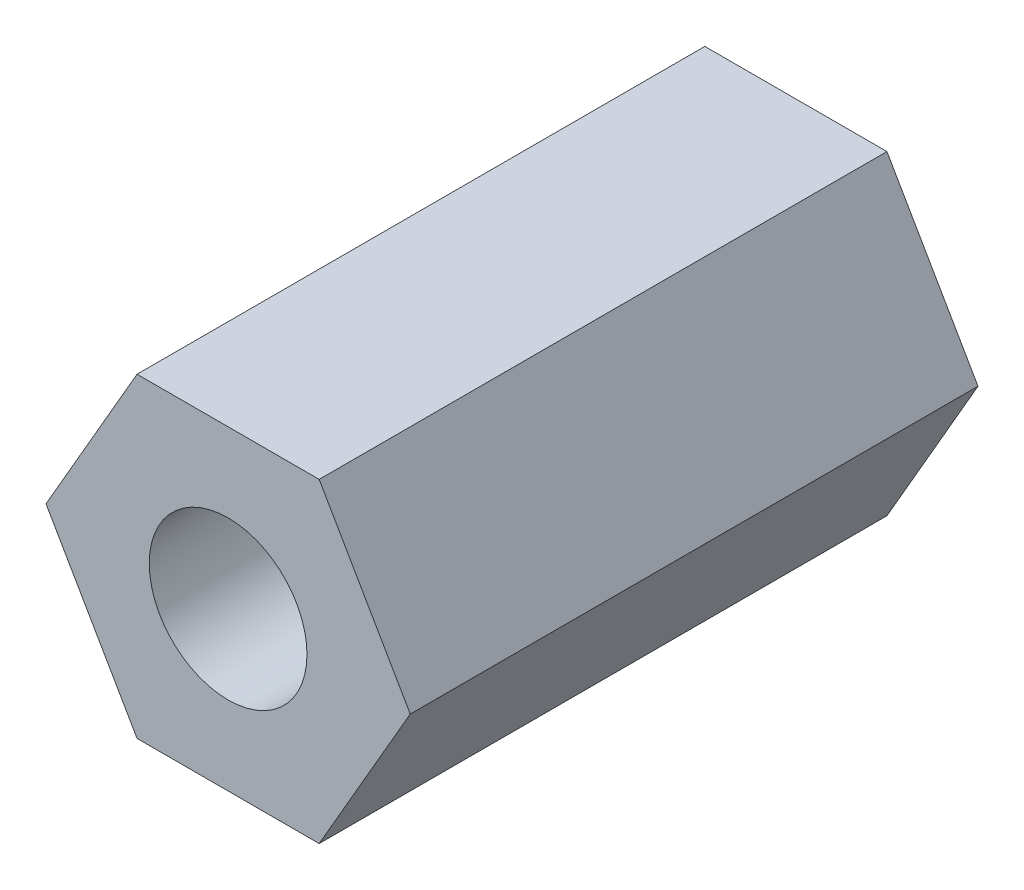
ISO-10303-21;
HEADER;
FILE_DESCRIPTION(('STEP AP214'),'2;1');
FILE_NAME('part.step','',(''),(''),'','','');
FILE_SCHEMA(('AUTOMOTIVE_DESIGN { 1 0 10303 214 1 1 1 1 }'));
ENDSEC;
DATA;
#1=APPLICATION_CONTEXT('core data for automotive mechanical design processes');
#2=APPLICATION_PROTOCOL_DEFINITION('international standard','automotive_design',2000,#1);
#3=PRODUCT_CONTEXT('',#1,'mechanical');
#4=PRODUCT('Part','Part','',(#3));
#5=PRODUCT_RELATED_PRODUCT_CATEGORY('part','',(#4));
#6=PRODUCT_DEFINITION_FORMATION('','',#4);
#7=PRODUCT_DEFINITION_CONTEXT('part definition',#1,'design');
#8=PRODUCT_DEFINITION('design','',#6,#7);
#9=PRODUCT_DEFINITION_SHAPE('','',#8);
#10=(LENGTH_UNIT() NAMED_UNIT(*) SI_UNIT(.MILLI.,.METRE.));
#11=(NAMED_UNIT(*) PLANE_ANGLE_UNIT() SI_UNIT($,.RADIAN.));
#12=(NAMED_UNIT(*) SI_UNIT($,.STERADIAN.) SOLID_ANGLE_UNIT());
#13=UNCERTAINTY_MEASURE_WITH_UNIT(LENGTH_MEASURE(1.E-05),#10,'distance_accuracy_value','');
#14=(GEOMETRIC_REPRESENTATION_CONTEXT(3) GLOBAL_UNCERTAINTY_ASSIGNED_CONTEXT((#13)) GLOBAL_UNIT_ASSIGNED_CONTEXT((#10,
#11,#12)) REPRESENTATION_CONTEXT('',''));
#15=CARTESIAN_POINT('',(0.,0.,0.));
#16=DIRECTION('',(0.,0.,1.));
#17=DIRECTION('',(1.,0.,0.));
#18=AXIS2_PLACEMENT_3D('',#15,#16,#17);
#19=CARTESIAN_POINT('',(1.44337567297406,2.5,9.));
#20=DIRECTION('',(0.,-1.,0.));
#21=DIRECTION('',(1.,0.,0.));
#22=AXIS2_PLACEMENT_3D('',#19,#20,#21);
#23=PLANE('',#22);
#24=DIRECTION('',(-1.,0.,0.));
#25=VECTOR('',#24,1.);
#26=CARTESIAN_POINT('',(1.44337567297406,2.5,0.));
#27=LINE('',#26,#25);
#28=CARTESIAN_POINT('',(1.44337567297406,2.5,0.));
#29=VERTEX_POINT('',#28);
#30=CARTESIAN_POINT('',(-1.44337567297407,2.5,0.));
#31=VERTEX_POINT('',#30);
#32=EDGE_CURVE('E117',#29,#31,#27,.T.);
#33=ORIENTED_EDGE('',*,*,#32,.T.);
#34=DIRECTION('',(0.,0.,-1.));
#35=VECTOR('',#34,1.);
#36=CARTESIAN_POINT('',(-1.44337567297407,2.5,9.));
#37=LINE('',#36,#35);
#38=CARTESIAN_POINT('',(-1.44337567297407,2.5,9.));
#39=VERTEX_POINT('',#38);
#40=EDGE_CURVE('E11',#39,#31,#37,.T.);
#41=ORIENTED_EDGE('',*,*,#40,.F.);
#42=DIRECTION('',(-1.,0.,0.));
#43=VECTOR('',#42,1.);
#44=CARTESIAN_POINT('',(1.44337567297406,2.5,9.));
#45=LINE('',#44,#43);
#46=CARTESIAN_POINT('',(1.44337567297406,2.5,9.));
#47=VERTEX_POINT('',#46);
#48=EDGE_CURVE('E128',#47,#39,#45,.T.);
#49=ORIENTED_EDGE('',*,*,#48,.F.);
#50=DIRECTION('',(0.,0.,-1.));
#51=VECTOR('',#50,1.);
#52=CARTESIAN_POINT('',(1.44337567297406,2.5,9.));
#53=LINE('',#52,#51);
#54=EDGE_CURVE('E113',#47,#29,#53,.T.);
#55=ORIENTED_EDGE('',*,*,#54,.T.);
#56=EDGE_LOOP('',(#33,#41,#49,#55));
#57=FACE_BOUND('',#56,.T.);
#58=ADVANCED_FACE('F33',(#57),#23,.F.);
#59=CARTESIAN_POINT('',(-1.44337567297407,2.5,9.));
#60=DIRECTION('',(0.866025403784439,-0.5,0.));
#61=DIRECTION('',(0.5,0.866025403784439,0.));
#62=AXIS2_PLACEMENT_3D('',#59,#60,#61);
#63=PLANE('',#62);
#64=DIRECTION('',(-0.5,-0.866025403784439,0.));
#65=VECTOR('',#64,1.);
#66=CARTESIAN_POINT('',(-1.44337567297407,2.5,0.));
#67=LINE('',#66,#65);
#68=CARTESIAN_POINT('',(-2.88675134594813,0.,0.));
#69=VERTEX_POINT('',#68);
#70=EDGE_CURVE('E120',#31,#69,#67,.T.);
#71=ORIENTED_EDGE('',*,*,#70,.T.);
#72=DIRECTION('',(0.,0.,-1.));
#73=VECTOR('',#72,1.);
#74=CARTESIAN_POINT('',(-2.88675134594813,0.,9.));
#75=LINE('',#74,#73);
#76=CARTESIAN_POINT('',(-2.88675134594813,0.,9.));
#77=VERTEX_POINT('',#76);
#78=EDGE_CURVE('E41',#77,#69,#75,.T.);
#79=ORIENTED_EDGE('',*,*,#78,.F.);
#80=DIRECTION('',(-0.5,-0.866025403784439,0.));
#81=VECTOR('',#80,1.);
#82=CARTESIAN_POINT('',(-1.44337567297407,2.5,9.));
#83=LINE('',#82,#81);
#84=EDGE_CURVE('E86',#39,#77,#83,.T.);
#85=ORIENTED_EDGE('',*,*,#84,.F.);
#86=ORIENTED_EDGE('',*,*,#40,.T.);
#87=EDGE_LOOP('',(#71,#79,#85,#86));
#88=FACE_BOUND('',#87,.T.);
#89=ADVANCED_FACE('F153',(#88),#63,.F.);
#90=CARTESIAN_POINT('',(-2.88675134594813,0.,9.));
#91=DIRECTION('',(0.866025403784438,0.5,0.));
#92=DIRECTION('',(-0.500000000000001,0.866025403784438,0.));
#93=AXIS2_PLACEMENT_3D('',#90,#91,#92);
#94=PLANE('',#93);
#95=DIRECTION('',(0.5,-0.866025403784438,0.));
#96=VECTOR('',#95,1.);
#97=CARTESIAN_POINT('',(-2.88675134594813,0.,0.));
#98=LINE('',#97,#96);
#99=CARTESIAN_POINT('',(-1.44337567297406,-2.5,0.));
#100=VERTEX_POINT('',#99);
#101=EDGE_CURVE('E123',#69,#100,#98,.T.);
#102=ORIENTED_EDGE('',*,*,#101,.T.);
#103=DIRECTION('',(0.,0.,-1.));
#104=VECTOR('',#103,1.);
#105=CARTESIAN_POINT('',(-1.44337567297406,-2.5,9.));
#106=LINE('',#105,#104);
#107=CARTESIAN_POINT('',(-1.44337567297406,-2.5,9.));
#108=VERTEX_POINT('',#107);
#109=EDGE_CURVE('E108',#108,#100,#106,.T.);
#110=ORIENTED_EDGE('',*,*,#109,.F.);
#111=DIRECTION('',(0.5,-0.866025403784438,0.));
#112=VECTOR('',#111,1.);
#113=CARTESIAN_POINT('',(-2.88675134594813,0.,9.));
#114=LINE('',#113,#112);
#115=EDGE_CURVE('E99',#77,#108,#114,.T.);
#116=ORIENTED_EDGE('',*,*,#115,.F.);
#117=ORIENTED_EDGE('',*,*,#78,.T.);
#118=EDGE_LOOP('',(#102,#110,#116,#117));
#119=FACE_BOUND('',#118,.T.);
#120=ADVANCED_FACE('F134',(#119),#94,.F.);
#121=CARTESIAN_POINT('',(-1.44337567297406,-2.5,9.));
#122=DIRECTION('',(0.,1.,0.));
#123=DIRECTION('',(-1.,0.,0.));
#124=AXIS2_PLACEMENT_3D('',#121,#122,#123);
#125=PLANE('',#124);
#126=DIRECTION('',(1.,0.,0.));
#127=VECTOR('',#126,1.);
#128=CARTESIAN_POINT('',(-1.44337567297406,-2.5,0.));
#129=LINE('',#128,#127);
#130=CARTESIAN_POINT('',(1.44337567297407,-2.5,0.));
#131=VERTEX_POINT('',#130);
#132=EDGE_CURVE('E107',#100,#131,#129,.T.);
#133=ORIENTED_EDGE('',*,*,#132,.T.);
#134=DIRECTION('',(0.,0.,-1.));
#135=VECTOR('',#134,1.);
#136=CARTESIAN_POINT('',(1.44337567297407,-2.5,9.));
#137=LINE('',#136,#135);
#138=CARTESIAN_POINT('',(1.44337567297407,-2.5,9.));
#139=VERTEX_POINT('',#138);
#140=EDGE_CURVE('E104',#139,#131,#137,.T.);
#141=ORIENTED_EDGE('',*,*,#140,.F.);
#142=DIRECTION('',(1.,0.,0.));
#143=VECTOR('',#142,1.);
#144=CARTESIAN_POINT('',(-1.44337567297406,-2.5,9.));
#145=LINE('',#144,#143);
#146=EDGE_CURVE('E93',#108,#139,#145,.T.);
#147=ORIENTED_EDGE('',*,*,#146,.F.);
#148=ORIENTED_EDGE('',*,*,#109,.T.);
#149=EDGE_LOOP('',(#133,#141,#147,#148));
#150=FACE_BOUND('',#149,.T.);
#151=ADVANCED_FACE('F105',(#150),#125,.F.);
#152=CARTESIAN_POINT('',(1.44337567297407,-2.5,9.));
#153=DIRECTION('',(-0.866025403784439,0.5,0.));
#154=DIRECTION('',(-0.5,-0.866025403784439,0.));
#155=AXIS2_PLACEMENT_3D('',#152,#153,#154);
#156=PLANE('',#155);
#157=DIRECTION('',(0.5,0.866025403784439,0.));
#158=VECTOR('',#157,1.);
#159=CARTESIAN_POINT('',(1.44337567297407,-2.5,0.));
#160=LINE('',#159,#158);
#161=CARTESIAN_POINT('',(2.88675134594813,0.,0.));
#162=VERTEX_POINT('',#161);
#163=EDGE_CURVE('E72',#131,#162,#160,.T.);
#164=ORIENTED_EDGE('',*,*,#163,.T.);
#165=DIRECTION('',(0.,0.,-1.));
#166=VECTOR('',#165,1.);
#167=CARTESIAN_POINT('',(2.88675134594813,0.,9.));
#168=LINE('',#167,#166);
#169=CARTESIAN_POINT('',(2.88675134594813,0.,9.));
#170=VERTEX_POINT('',#169);
#171=EDGE_CURVE('E109',#170,#162,#168,.T.);
#172=ORIENTED_EDGE('',*,*,#171,.F.);
#173=DIRECTION('',(0.5,0.866025403784439,0.));
#174=VECTOR('',#173,1.);
#175=CARTESIAN_POINT('',(1.44337567297407,-2.5,9.));
#176=LINE('',#175,#174);
#177=EDGE_CURVE('E97',#139,#170,#176,.T.);
#178=ORIENTED_EDGE('',*,*,#177,.F.);
#179=ORIENTED_EDGE('',*,*,#140,.T.);
#180=EDGE_LOOP('',(#164,#172,#178,#179));
#181=FACE_BOUND('',#180,.T.);
#182=ADVANCED_FACE('F111',(#181),#156,.F.);
#183=CARTESIAN_POINT('',(2.88675134594813,0.,9.));
#184=DIRECTION('',(-0.866025403784439,-0.5,0.));
#185=DIRECTION('',(0.5,-0.866025403784439,0.));
#186=AXIS2_PLACEMENT_3D('',#183,#184,#185);
#187=PLANE('',#186);
#188=DIRECTION('',(-0.5,0.866025403784439,0.));
#189=VECTOR('',#188,1.);
#190=CARTESIAN_POINT('',(2.88675134594813,0.,0.));
#191=LINE('',#190,#189);
#192=EDGE_CURVE('E78',#162,#29,#191,.T.);
#193=ORIENTED_EDGE('',*,*,#192,.T.);
#194=ORIENTED_EDGE('',*,*,#54,.F.);
#195=DIRECTION('',(-0.5,0.866025403784439,0.));
#196=VECTOR('',#195,1.);
#197=CARTESIAN_POINT('',(2.88675134594813,0.,9.));
#198=LINE('',#197,#196);
#199=EDGE_CURVE('E49',#170,#47,#198,.T.);
#200=ORIENTED_EDGE('',*,*,#199,.F.);
#201=ORIENTED_EDGE('',*,*,#171,.T.);
#202=EDGE_LOOP('',(#193,#194,#200,#201));
#203=FACE_BOUND('',#202,.T.);
#204=ADVANCED_FACE('F141',(#203),#187,.F.);
#205=CARTESIAN_POINT('',(0.,0.,9.));
#206=DIRECTION('',(0.,0.,1.));
#207=DIRECTION('',(1.,0.,0.));
#208=AXIS2_PLACEMENT_3D('',#205,#206,#207);
#209=PLANE('',#208);
#210=CARTESIAN_POINT('',(0.,0.,9.));
#211=DIRECTION('',(0.,0.,1.));
#212=DIRECTION('',(1.,0.,0.));
#213=AXIS2_PLACEMENT_3D('',#210,#211,#212);
#214=CIRCLE('',#213,1.24999999999999);
#215=CARTESIAN_POINT('',(1.24999999999999,0.,9.));
#216=VERTEX_POINT('',#215);
#217=EDGE_CURVE('E208',#216,#216,#214,.T.);
#218=ORIENTED_EDGE('',*,*,#217,.F.);
#219=EDGE_LOOP('',(#218));
#220=FACE_BOUND('',#219,.T.);
#221=ORIENTED_EDGE('',*,*,#48,.T.);
#222=ORIENTED_EDGE('',*,*,#84,.T.);
#223=ORIENTED_EDGE('',*,*,#115,.T.);
#224=ORIENTED_EDGE('',*,*,#146,.T.);
#225=ORIENTED_EDGE('',*,*,#177,.T.);
#226=ORIENTED_EDGE('',*,*,#199,.T.);
#227=EDGE_LOOP('',(#221,#222,#223,#224,#225,#226));
#228=FACE_BOUND('',#227,.T.);
#229=ADVANCED_FACE('F95',(#220,#228),#209,.T.);
#230=CARTESIAN_POINT('',(0.,0.,0.));
#231=DIRECTION('',(0.,0.,1.));
#232=DIRECTION('',(1.,0.,0.));
#233=AXIS2_PLACEMENT_3D('',#230,#231,#232);
#234=PLANE('',#233);
#235=CARTESIAN_POINT('',(0.,0.,0.));
#236=DIRECTION('',(0.,0.,1.));
#237=DIRECTION('',(1.,0.,0.));
#238=AXIS2_PLACEMENT_3D('',#235,#236,#237);
#239=CIRCLE('',#238,1.25);
#240=CARTESIAN_POINT('',(1.25,0.,0.));
#241=VERTEX_POINT('',#240);
#242=EDGE_CURVE('E121',#241,#241,#239,.T.);
#243=ORIENTED_EDGE('',*,*,#242,.T.);
#244=EDGE_LOOP('',(#243));
#245=FACE_BOUND('',#244,.T.);
#246=ORIENTED_EDGE('',*,*,#32,.F.);
#247=ORIENTED_EDGE('',*,*,#192,.F.);
#248=ORIENTED_EDGE('',*,*,#163,.F.);
#249=ORIENTED_EDGE('',*,*,#132,.F.);
#250=ORIENTED_EDGE('',*,*,#101,.F.);
#251=ORIENTED_EDGE('',*,*,#70,.F.);
#252=EDGE_LOOP('',(#246,#247,#248,#249,#250,#251));
#253=FACE_BOUND('',#252,.T.);
#254=ADVANCED_FACE('F137',(#245,#253),#234,.F.);
#255=CARTESIAN_POINT('',(0.,0.,9.));
#256=DIRECTION('',(0.,0.,1.));
#257=DIRECTION('',(1.,0.,0.));
#258=AXIS2_PLACEMENT_3D('',#255,#256,#257);
#259=CYLINDRICAL_SURFACE('',#258,1.24999999999999);
#260=ORIENTED_EDGE('',*,*,#242,.F.);
#261=EDGE_LOOP('',(#260));
#262=FACE_BOUND('',#261,.T.);
#263=ORIENTED_EDGE('',*,*,#217,.T.);
#264=EDGE_LOOP('',(#263));
#265=FACE_BOUND('',#264,.T.);
#266=ADVANCED_FACE('F190',(#262,#265),#259,.F.);
#267=CLOSED_SHELL('',(#58,#89,#120,#151,#182,#204,#229,#254,#266));
#268=MANIFOLD_SOLID_BREP('B2',#267);
#269=ADVANCED_BREP_SHAPE_REPRESENTATION('',(#18,#268),#14);
#270=SHAPE_DEFINITION_REPRESENTATION(#9,#269);
ENDSEC;
END-ISO-10303-21;
